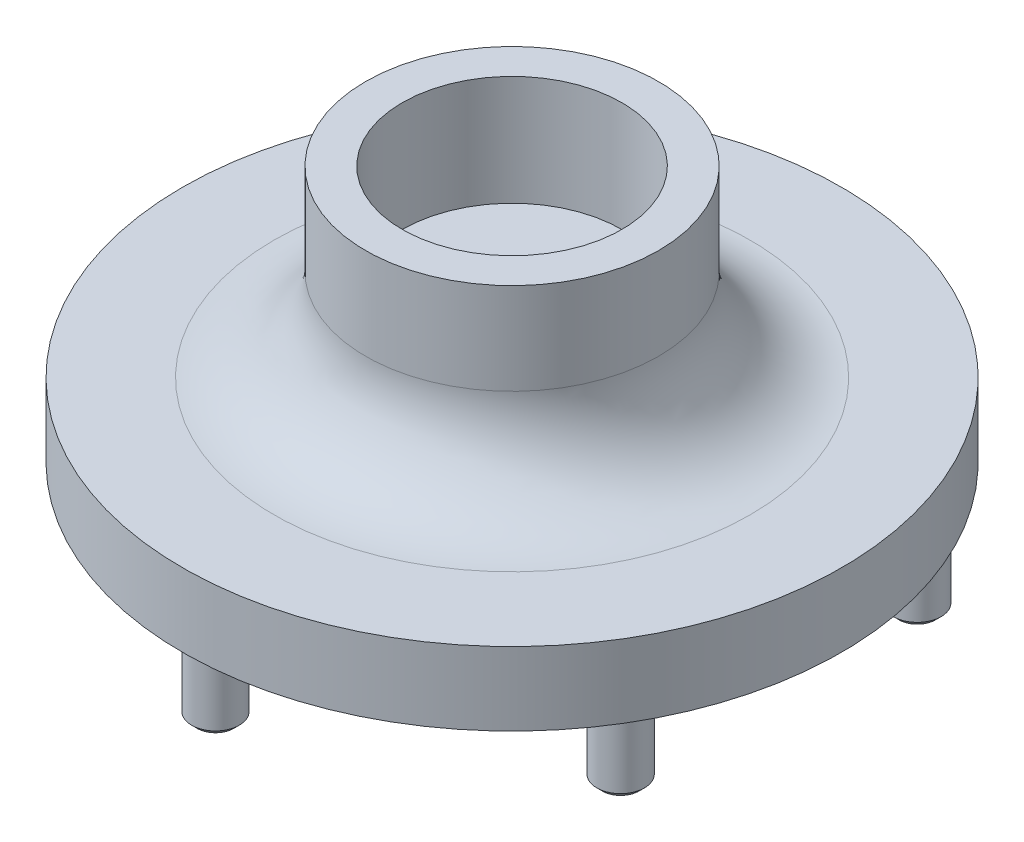
ISO-10303-21;
HEADER;
FILE_DESCRIPTION(('STEP AP214'),'2;1');
FILE_NAME('part.step','',(''),(''),'','','');
FILE_SCHEMA(('AUTOMOTIVE_DESIGN { 1 0 10303 214 1 1 1 1 }'));
ENDSEC;
DATA;
#1=APPLICATION_CONTEXT('core data for automotive mechanical design processes');
#2=APPLICATION_PROTOCOL_DEFINITION('international standard','automotive_design',2000,#1);
#3=PRODUCT_CONTEXT('',#1,'mechanical');
#4=PRODUCT('Part','Part','',(#3));
#5=PRODUCT_RELATED_PRODUCT_CATEGORY('part','',(#4));
#6=PRODUCT_DEFINITION_FORMATION('','',#4);
#7=PRODUCT_DEFINITION_CONTEXT('part definition',#1,'design');
#8=PRODUCT_DEFINITION('design','',#6,#7);
#9=PRODUCT_DEFINITION_SHAPE('','',#8);
#10=(LENGTH_UNIT() NAMED_UNIT(*) SI_UNIT(.MILLI.,.METRE.));
#11=(NAMED_UNIT(*) PLANE_ANGLE_UNIT() SI_UNIT($,.RADIAN.));
#12=(NAMED_UNIT(*) SI_UNIT($,.STERADIAN.) SOLID_ANGLE_UNIT());
#13=UNCERTAINTY_MEASURE_WITH_UNIT(LENGTH_MEASURE(1.E-05),#10,'distance_accuracy_value','');
#14=(GEOMETRIC_REPRESENTATION_CONTEXT(3) GLOBAL_UNCERTAINTY_ASSIGNED_CONTEXT((#13)) GLOBAL_UNIT_ASSIGNED_CONTEXT((#10,
#11,#12)) REPRESENTATION_CONTEXT('',''));
#15=CARTESIAN_POINT('',(0.,0.,0.));
#16=DIRECTION('',(0.,0.,1.));
#17=DIRECTION('',(1.,0.,0.));
#18=AXIS2_PLACEMENT_3D('',#15,#16,#17);
#19=CARTESIAN_POINT('',(0.,0.,0.));
#20=DIRECTION('',(0.,1.,0.));
#21=DIRECTION('',(-1.,0.,0.));
#22=AXIS2_PLACEMENT_3D('',#19,#20,#21);
#23=PLANE('',#22);
#24=CARTESIAN_POINT('',(0.,0.,0.));
#25=DIRECTION('',(0.,1.,0.));
#26=DIRECTION('',(-1.,0.,0.));
#27=AXIS2_PLACEMENT_3D('',#24,#25,#26);
#28=CIRCLE('',#27,16.1432512575363);
#29=CARTESIAN_POINT('',(-16.1432512575363,0.,0.));
#30=VERTEX_POINT('',#29);
#31=EDGE_CURVE('E10',#30,#30,#28,.F.);
#32=ORIENTED_EDGE('',*,*,#31,.T.);
#33=EDGE_LOOP('',(#32));
#34=FACE_BOUND('',#33,.T.);
#35=ADVANCED_FACE('F41',(#34),#23,.F.);
#36=CARTESIAN_POINT('',(0.,75.,0.));
#37=DIRECTION('',(0.,1.,0.));
#38=DIRECTION('',(-1.,0.,0.));
#39=AXIS2_PLACEMENT_3D('',#36,#37,#38);
#40=CYLINDRICAL_SURFACE('',#39,50.);
#41=CARTESIAN_POINT('',(0.,35.,0.));
#42=DIRECTION('',(0.,1.,0.));
#43=DIRECTION('',(-1.,0.,0.));
#44=AXIS2_PLACEMENT_3D('',#41,#42,#43);
#45=CIRCLE('',#44,50.);
#46=CARTESIAN_POINT('',(-50.,35.,0.));
#47=VERTEX_POINT('',#46);
#48=EDGE_CURVE('E112',#47,#47,#45,.T.);
#49=ORIENTED_EDGE('',*,*,#48,.F.);
#50=EDGE_LOOP('',(#49));
#51=FACE_BOUND('',#50,.T.);
#52=CARTESIAN_POINT('',(0.,30.,0.));
#53=DIRECTION('',(0.,1.,0.));
#54=DIRECTION('',(-1.,0.,0.));
#55=AXIS2_PLACEMENT_3D('',#52,#53,#54);
#56=CIRCLE('',#55,50.);
#57=CARTESIAN_POINT('',(-50.,30.,0.));
#58=VERTEX_POINT('',#57);
#59=EDGE_CURVE('E115',#58,#58,#56,.T.);
#60=ORIENTED_EDGE('',*,*,#59,.T.);
#61=EDGE_LOOP('',(#60));
#62=FACE_BOUND('',#61,.T.);
#63=ADVANCED_FACE('F157',(#51,#62),#40,.T.);
#64=CARTESIAN_POINT('',(0.,35.,0.));
#65=DIRECTION('',(0.,1.,0.));
#66=DIRECTION('',(-1.,0.,0.));
#67=AXIS2_PLACEMENT_3D('',#64,#65,#66);
#68=PLANE('',#67);
#69=CARTESIAN_POINT('',(-70.1480577065391,35.,-40.5000000000008));
#70=DIRECTION('',(0.,1.,0.));
#71=DIRECTION('',(-1.,0.,0.));
#72=AXIS2_PLACEMENT_3D('',#69,#70,#71);
#73=CIRCLE('',#72,6.5);
#74=CARTESIAN_POINT('',(-76.6480577065391,35.,-40.5000000000008));
#75=VERTEX_POINT('',#74);
#76=EDGE_CURVE('E133',#75,#75,#73,.T.);
#77=ORIENTED_EDGE('',*,*,#76,.T.);
#78=EDGE_LOOP('',(#77));
#79=FACE_BOUND('',#78,.T.);
#80=CARTESIAN_POINT('',(-70.1480577065399,35.,40.4999999999993));
#81=DIRECTION('',(0.,1.,0.));
#82=DIRECTION('',(-1.,0.,0.));
#83=AXIS2_PLACEMENT_3D('',#80,#81,#82);
#84=CIRCLE('',#83,6.5);
#85=CARTESIAN_POINT('',(-76.6480577065399,35.,40.4999999999993));
#86=VERTEX_POINT('',#85);
#87=EDGE_CURVE('E130',#86,#86,#84,.T.);
#88=ORIENTED_EDGE('',*,*,#87,.T.);
#89=EDGE_LOOP('',(#88));
#90=FACE_BOUND('',#89,.T.);
#91=CARTESIAN_POINT('',(0.,35.,81.));
#92=DIRECTION('',(0.,1.,0.));
#93=DIRECTION('',(-1.,0.,0.));
#94=AXIS2_PLACEMENT_3D('',#91,#92,#93);
#95=CIRCLE('',#94,6.5);
#96=CARTESIAN_POINT('',(-6.5,35.,81.));
#97=VERTEX_POINT('',#96);
#98=EDGE_CURVE('E127',#97,#97,#95,.T.);
#99=ORIENTED_EDGE('',*,*,#98,.T.);
#100=EDGE_LOOP('',(#99));
#101=FACE_BOUND('',#100,.T.);
#102=CARTESIAN_POINT('',(70.1480577065393,35.,40.5000000000003));
#103=DIRECTION('',(0.,1.,0.));
#104=DIRECTION('',(-1.,0.,0.));
#105=AXIS2_PLACEMENT_3D('',#102,#103,#104);
#106=CIRCLE('',#105,6.5);
#107=CARTESIAN_POINT('',(63.6480577065393,35.,40.5000000000003));
#108=VERTEX_POINT('',#107);
#109=EDGE_CURVE('E124',#108,#108,#106,.T.);
#110=ORIENTED_EDGE('',*,*,#109,.T.);
#111=EDGE_LOOP('',(#110));
#112=FACE_BOUND('',#111,.T.);
#113=CARTESIAN_POINT('',(70.1480577065396,35.,-40.4999999999998));
#114=DIRECTION('',(0.,1.,0.));
#115=DIRECTION('',(-1.,0.,0.));
#116=AXIS2_PLACEMENT_3D('',#113,#114,#115);
#117=CIRCLE('',#116,6.5);
#118=CARTESIAN_POINT('',(63.6480577065396,35.,-40.4999999999998));
#119=VERTEX_POINT('',#118);
#120=EDGE_CURVE('E121',#119,#119,#117,.T.);
#121=ORIENTED_EDGE('',*,*,#120,.T.);
#122=EDGE_LOOP('',(#121));
#123=FACE_BOUND('',#122,.T.);
#124=CARTESIAN_POINT('',(0.,35.,-81.));
#125=DIRECTION('',(0.,1.,0.));
#126=DIRECTION('',(-1.,0.,0.));
#127=AXIS2_PLACEMENT_3D('',#124,#125,#126);
#128=CIRCLE('',#127,6.5);
#129=CARTESIAN_POINT('',(-6.5,35.,-81.));
#130=VERTEX_POINT('',#129);
#131=EDGE_CURVE('E118',#130,#130,#128,.T.);
#132=ORIENTED_EDGE('',*,*,#131,.T.);
#133=EDGE_LOOP('',(#132));
#134=FACE_BOUND('',#133,.T.);
#135=CARTESIAN_POINT('',(0.,35.,0.));
#136=DIRECTION('',(0.,1.,0.));
#137=DIRECTION('',(-1.,0.,0.));
#138=AXIS2_PLACEMENT_3D('',#135,#136,#137);
#139=CIRCLE('',#138,90.);
#140=CARTESIAN_POINT('',(-90.,35.,0.));
#141=VERTEX_POINT('',#140);
#142=EDGE_CURVE('E109',#141,#141,#139,.T.);
#143=ORIENTED_EDGE('',*,*,#142,.F.);
#144=EDGE_LOOP('',(#143));
#145=FACE_BOUND('',#144,.T.);
#146=ORIENTED_EDGE('',*,*,#48,.T.);
#147=EDGE_LOOP('',(#146));
#148=FACE_BOUND('',#147,.T.);
#149=ADVANCED_FACE('F137',(#79,#90,#101,#112,#123,#134,#145,#148),#68,.F.);
#150=CARTESIAN_POINT('',(0.,75.,0.));
#151=DIRECTION('',(0.,1.,0.));
#152=DIRECTION('',(-1.,0.,0.));
#153=AXIS2_PLACEMENT_3D('',#150,#151,#152);
#154=CYLINDRICAL_SURFACE('',#153,90.);
#155=CARTESIAN_POINT('',(0.,55.,0.));
#156=DIRECTION('',(0.,1.,0.));
#157=DIRECTION('',(-1.,0.,0.));
#158=AXIS2_PLACEMENT_3D('',#155,#156,#157);
#159=CIRCLE('',#158,90.);
#160=CARTESIAN_POINT('',(-90.,55.,0.));
#161=VERTEX_POINT('',#160);
#162=EDGE_CURVE('E106',#161,#161,#159,.T.);
#163=ORIENTED_EDGE('',*,*,#162,.F.);
#164=EDGE_LOOP('',(#163));
#165=FACE_BOUND('',#164,.T.);
#166=ORIENTED_EDGE('',*,*,#142,.T.);
#167=EDGE_LOOP('',(#166));
#168=FACE_BOUND('',#167,.T.);
#169=ADVANCED_FACE('F170',(#165,#168),#154,.T.);
#170=CARTESIAN_POINT('',(0.,55.,0.));
#171=DIRECTION('',(0.,-1.,0.));
#172=DIRECTION('',(1.,0.,0.));
#173=AXIS2_PLACEMENT_3D('',#170,#171,#172);
#174=PLANE('',#173);
#175=CARTESIAN_POINT('',(0.,55.,0.));
#176=DIRECTION('',(0.,-1.,0.));
#177=DIRECTION('',(1.,0.,0.));
#178=AXIS2_PLACEMENT_3D('',#175,#176,#177);
#179=CIRCLE('',#178,65.);
#180=CARTESIAN_POINT('',(65.,55.,0.));
#181=VERTEX_POINT('',#180);
#182=EDGE_CURVE('E52',#181,#181,#179,.T.);
#183=ORIENTED_EDGE('',*,*,#182,.T.);
#184=EDGE_LOOP('',(#183));
#185=FACE_BOUND('',#184,.T.);
#186=ORIENTED_EDGE('',*,*,#162,.T.);
#187=EDGE_LOOP('',(#186));
#188=FACE_BOUND('',#187,.T.);
#189=ADVANCED_FACE('F173',(#185,#188),#174,.F.);
#190=CARTESIAN_POINT('',(0.,75.,0.));
#191=DIRECTION('',(0.,1.,0.));
#192=DIRECTION('',(-1.,0.,0.));
#193=AXIS2_PLACEMENT_3D('',#190,#191,#192);
#194=CYLINDRICAL_SURFACE('',#193,40.);
#195=CARTESIAN_POINT('',(0.,80.,0.));
#196=DIRECTION('',(0.,-1.,0.));
#197=DIRECTION('',(1.,0.,0.));
#198=AXIS2_PLACEMENT_3D('',#195,#196,#197);
#199=CIRCLE('',#198,40.);
#200=CARTESIAN_POINT('',(40.,80.,0.));
#201=VERTEX_POINT('',#200);
#202=EDGE_CURVE('E56',#201,#201,#199,.F.);
#203=ORIENTED_EDGE('',*,*,#202,.T.);
#204=EDGE_LOOP('',(#203));
#205=FACE_BOUND('',#204,.T.);
#206=CARTESIAN_POINT('',(0.,105.,0.));
#207=DIRECTION('',(0.,1.,0.));
#208=DIRECTION('',(-1.,0.,0.));
#209=AXIS2_PLACEMENT_3D('',#206,#207,#208);
#210=CIRCLE('',#209,40.);
#211=CARTESIAN_POINT('',(-40.,105.,0.));
#212=VERTEX_POINT('',#211);
#213=EDGE_CURVE('E103',#212,#212,#210,.T.);
#214=ORIENTED_EDGE('',*,*,#213,.F.);
#215=EDGE_LOOP('',(#214));
#216=FACE_BOUND('',#215,.T.);
#217=ADVANCED_FACE('F177',(#205,#216),#194,.T.);
#218=CARTESIAN_POINT('',(0.,105.,0.));
#219=DIRECTION('',(0.,-1.,0.));
#220=DIRECTION('',(1.,0.,0.));
#221=AXIS2_PLACEMENT_3D('',#218,#219,#220);
#222=PLANE('',#221);
#223=CARTESIAN_POINT('',(0.,105.,0.));
#224=DIRECTION('',(0.,1.,0.));
#225=DIRECTION('',(-1.,0.,0.));
#226=AXIS2_PLACEMENT_3D('',#223,#224,#225);
#227=CIRCLE('',#226,30.);
#228=CARTESIAN_POINT('',(-30.,105.,0.));
#229=VERTEX_POINT('',#228);
#230=EDGE_CURVE('E100',#229,#229,#227,.T.);
#231=ORIENTED_EDGE('',*,*,#230,.F.);
#232=EDGE_LOOP('',(#231));
#233=FACE_BOUND('',#232,.T.);
#234=ORIENTED_EDGE('',*,*,#213,.T.);
#235=EDGE_LOOP('',(#234));
#236=FACE_BOUND('',#235,.T.);
#237=ADVANCED_FACE('F181',(#233,#236),#222,.F.);
#238=CARTESIAN_POINT('',(0.,75.,0.));
#239=DIRECTION('',(0.,1.,0.));
#240=DIRECTION('',(-1.,0.,0.));
#241=AXIS2_PLACEMENT_3D('',#238,#239,#240);
#242=CYLINDRICAL_SURFACE('',#241,30.);
#243=CARTESIAN_POINT('',(0.,75.,0.));
#244=DIRECTION('',(0.,1.,0.));
#245=DIRECTION('',(-1.,0.,0.));
#246=AXIS2_PLACEMENT_3D('',#243,#244,#245);
#247=CIRCLE('',#246,30.);
#248=CARTESIAN_POINT('',(-30.,75.,0.));
#249=VERTEX_POINT('',#248);
#250=EDGE_CURVE('E97',#249,#249,#247,.T.);
#251=ORIENTED_EDGE('',*,*,#250,.F.);
#252=EDGE_LOOP('',(#251));
#253=FACE_BOUND('',#252,.T.);
#254=ORIENTED_EDGE('',*,*,#230,.T.);
#255=EDGE_LOOP('',(#254));
#256=FACE_BOUND('',#255,.T.);
#257=ADVANCED_FACE('F185',(#253,#256),#242,.F.);
#258=CARTESIAN_POINT('',(0.,75.,0.));
#259=DIRECTION('',(0.,-1.,0.));
#260=DIRECTION('',(1.,0.,0.));
#261=AXIS2_PLACEMENT_3D('',#258,#259,#260);
#262=PLANE('',#261);
#263=ORIENTED_EDGE('',*,*,#250,.T.);
#264=EDGE_LOOP('',(#263));
#265=FACE_BOUND('',#264,.T.);
#266=ADVANCED_FACE('F189',(#265),#262,.F.);
#267=CARTESIAN_POINT('',(0.,15.,-81.));
#268=DIRECTION('',(0.,1.,0.));
#269=DIRECTION('',(-1.,0.,0.));
#270=AXIS2_PLACEMENT_3D('',#267,#268,#269);
#271=CYLINDRICAL_SURFACE('',#270,6.5);
#272=CARTESIAN_POINT('',(0.,16.5,-81.));
#273=DIRECTION('',(0.,1.,0.));
#274=DIRECTION('',(-1.,0.,0.));
#275=AXIS2_PLACEMENT_3D('',#272,#273,#274);
#276=CIRCLE('',#275,6.5);
#277=CARTESIAN_POINT('',(-6.5,16.5,-81.));
#278=VERTEX_POINT('',#277);
#279=EDGE_CURVE('E70',#278,#278,#276,.T.);
#280=ORIENTED_EDGE('',*,*,#279,.T.);
#281=EDGE_LOOP('',(#280));
#282=FACE_BOUND('',#281,.T.);
#283=ORIENTED_EDGE('',*,*,#131,.F.);
#284=EDGE_LOOP('',(#283));
#285=FACE_BOUND('',#284,.T.);
#286=ADVANCED_FACE('F165',(#282,#285),#271,.T.);
#287=CARTESIAN_POINT('',(0.,15.,-81.));
#288=DIRECTION('',(0.,1.,0.));
#289=DIRECTION('',(-1.,0.,0.));
#290=AXIS2_PLACEMENT_3D('',#287,#288,#289);
#291=PLANE('',#290);
#292=CARTESIAN_POINT('',(0.,15.,-81.));
#293=DIRECTION('',(0.,1.,0.));
#294=DIRECTION('',(-1.,0.,0.));
#295=AXIS2_PLACEMENT_3D('',#292,#293,#294);
#296=CIRCLE('',#295,5.);
#297=CARTESIAN_POINT('',(-5.,15.,-81.));
#298=VERTEX_POINT('',#297);
#299=EDGE_CURVE('E67',#298,#298,#296,.F.);
#300=ORIENTED_EDGE('',*,*,#299,.T.);
#301=EDGE_LOOP('',(#300));
#302=FACE_BOUND('',#301,.T.);
#303=ADVANCED_FACE('F444',(#302),#291,.F.);
#304=CARTESIAN_POINT('',(70.1480577065396,15.,-40.4999999999998));
#305=DIRECTION('',(0.,1.,0.));
#306=DIRECTION('',(-1.,0.,0.));
#307=AXIS2_PLACEMENT_3D('',#304,#305,#306);
#308=CYLINDRICAL_SURFACE('',#307,6.5);
#309=CARTESIAN_POINT('',(70.1480577065396,16.5,-40.4999999999998));
#310=DIRECTION('',(0.,1.,0.));
#311=DIRECTION('',(0.,0.,1.));
#312=AXIS2_PLACEMENT_3D('',#309,#310,#311);
#313=CIRCLE('',#312,6.5);
#314=CARTESIAN_POINT('',(70.1480577065396,16.5,-33.9999999999998));
#315=VERTEX_POINT('',#314);
#316=EDGE_CURVE('E76',#315,#315,#313,.T.);
#317=ORIENTED_EDGE('',*,*,#316,.T.);
#318=EDGE_LOOP('',(#317));
#319=FACE_BOUND('',#318,.T.);
#320=ORIENTED_EDGE('',*,*,#120,.F.);
#321=EDGE_LOOP('',(#320));
#322=FACE_BOUND('',#321,.T.);
#323=ADVANCED_FACE('F433',(#319,#322),#308,.T.);
#324=CARTESIAN_POINT('',(70.1480577065396,15.,-40.4999999999998));
#325=DIRECTION('',(0.,1.,0.));
#326=DIRECTION('',(-0.499999999999998,0.,-0.86602540378444));
#327=AXIS2_PLACEMENT_3D('',#324,#325,#326);
#328=PLANE('',#327);
#329=CARTESIAN_POINT('',(70.1480577065396,15.,-40.4999999999998));
#330=DIRECTION('',(0.,1.,0.));
#331=DIRECTION('',(-1.,0.,0.));
#332=AXIS2_PLACEMENT_3D('',#329,#330,#331);
#333=CIRCLE('',#332,4.99999999999999);
#334=CARTESIAN_POINT('',(65.1480577065396,15.,-40.4999999999998));
#335=VERTEX_POINT('',#334);
#336=EDGE_CURVE('E73',#335,#335,#333,.F.);
#337=ORIENTED_EDGE('',*,*,#336,.T.);
#338=EDGE_LOOP('',(#337));
#339=FACE_BOUND('',#338,.T.);
#340=ADVANCED_FACE('F422',(#339),#328,.F.);
#341=CARTESIAN_POINT('',(70.1480577065393,15.,40.5000000000003));
#342=DIRECTION('',(0.,1.,0.));
#343=DIRECTION('',(-1.,0.,0.));
#344=AXIS2_PLACEMENT_3D('',#341,#342,#343);
#345=CYLINDRICAL_SURFACE('',#344,6.5);
#346=CARTESIAN_POINT('',(70.1480577065393,16.5,40.5000000000003));
#347=DIRECTION('',(0.,1.,0.));
#348=DIRECTION('',(0.,0.,1.));
#349=AXIS2_PLACEMENT_3D('',#346,#347,#348);
#350=CIRCLE('',#349,6.5);
#351=CARTESIAN_POINT('',(70.1480577065393,16.5,47.0000000000003));
#352=VERTEX_POINT('',#351);
#353=EDGE_CURVE('E82',#352,#352,#350,.T.);
#354=ORIENTED_EDGE('',*,*,#353,.T.);
#355=EDGE_LOOP('',(#354));
#356=FACE_BOUND('',#355,.T.);
#357=ORIENTED_EDGE('',*,*,#109,.F.);
#358=EDGE_LOOP('',(#357));
#359=FACE_BOUND('',#358,.T.);
#360=ADVANCED_FACE('F410',(#356,#359),#345,.T.);
#361=CARTESIAN_POINT('',(70.1480577065393,15.,40.5000000000003));
#362=DIRECTION('',(0.,1.,0.));
#363=DIRECTION('',(0.500000000000004,0.,-0.866025403784436));
#364=AXIS2_PLACEMENT_3D('',#361,#362,#363);
#365=PLANE('',#364);
#366=CARTESIAN_POINT('',(70.1480577065393,15.,40.5000000000003));
#367=DIRECTION('',(0.,1.,0.));
#368=DIRECTION('',(-1.,0.,0.));
#369=AXIS2_PLACEMENT_3D('',#366,#367,#368);
#370=CIRCLE('',#369,4.99999999999998);
#371=CARTESIAN_POINT('',(65.1480577065394,15.,40.5000000000003));
#372=VERTEX_POINT('',#371);
#373=EDGE_CURVE('E79',#372,#372,#370,.F.);
#374=ORIENTED_EDGE('',*,*,#373,.T.);
#375=EDGE_LOOP('',(#374));
#376=FACE_BOUND('',#375,.T.);
#377=ADVANCED_FACE('F398',(#376),#365,.F.);
#378=CARTESIAN_POINT('',(0.,15.,81.));
#379=DIRECTION('',(0.,1.,0.));
#380=DIRECTION('',(-1.,0.,0.));
#381=AXIS2_PLACEMENT_3D('',#378,#379,#380);
#382=CYLINDRICAL_SURFACE('',#381,6.5);
#383=CARTESIAN_POINT('',(0.,16.5,81.));
#384=DIRECTION('',(0.,1.,0.));
#385=DIRECTION('',(-1.,0.,0.));
#386=AXIS2_PLACEMENT_3D('',#383,#384,#385);
#387=CIRCLE('',#386,6.5);
#388=CARTESIAN_POINT('',(-6.5,16.5,81.));
#389=VERTEX_POINT('',#388);
#390=EDGE_CURVE('E88',#389,#389,#387,.T.);
#391=ORIENTED_EDGE('',*,*,#390,.T.);
#392=EDGE_LOOP('',(#391));
#393=FACE_BOUND('',#392,.T.);
#394=ORIENTED_EDGE('',*,*,#98,.F.);
#395=EDGE_LOOP('',(#394));
#396=FACE_BOUND('',#395,.T.);
#397=ADVANCED_FACE('F386',(#393,#396),#382,.T.);
#398=CARTESIAN_POINT('',(0.,15.,81.));
#399=DIRECTION('',(0.,1.,0.));
#400=DIRECTION('',(1.,0.,0.));
#401=AXIS2_PLACEMENT_3D('',#398,#399,#400);
#402=PLANE('',#401);
#403=CARTESIAN_POINT('',(0.,15.,81.));
#404=DIRECTION('',(0.,1.,0.));
#405=DIRECTION('',(-1.,0.,0.));
#406=AXIS2_PLACEMENT_3D('',#403,#404,#405);
#407=CIRCLE('',#406,5.);
#408=CARTESIAN_POINT('',(-5.,15.,81.));
#409=VERTEX_POINT('',#408);
#410=EDGE_CURVE('E85',#409,#409,#407,.F.);
#411=ORIENTED_EDGE('',*,*,#410,.T.);
#412=EDGE_LOOP('',(#411));
#413=FACE_BOUND('',#412,.T.);
#414=ADVANCED_FACE('F374',(#413),#402,.F.);
#415=CARTESIAN_POINT('',(-70.1480577065399,15.,40.4999999999993));
#416=DIRECTION('',(0.,1.,0.));
#417=DIRECTION('',(-1.,0.,0.));
#418=AXIS2_PLACEMENT_3D('',#415,#416,#417);
#419=CYLINDRICAL_SURFACE('',#418,6.5);
#420=CARTESIAN_POINT('',(-70.1480577065399,16.4999999999999,40.4999999999993));
#421=DIRECTION('',(0.,1.,0.));
#422=DIRECTION('',(0.,0.,1.));
#423=AXIS2_PLACEMENT_3D('',#420,#421,#422);
#424=CIRCLE('',#423,6.5);
#425=CARTESIAN_POINT('',(-70.1480577065399,16.4999999999999,46.9999999999994));
#426=VERTEX_POINT('',#425);
#427=EDGE_CURVE('E94',#426,#426,#424,.T.);
#428=ORIENTED_EDGE('',*,*,#427,.T.);
#429=EDGE_LOOP('',(#428));
#430=FACE_BOUND('',#429,.T.);
#431=ORIENTED_EDGE('',*,*,#87,.F.);
#432=EDGE_LOOP('',(#431));
#433=FACE_BOUND('',#432,.T.);
#434=ADVANCED_FACE('F153',(#430,#433),#419,.T.);
#435=CARTESIAN_POINT('',(-70.1480577065399,15.,40.4999999999993));
#436=DIRECTION('',(0.,1.,0.));
#437=DIRECTION('',(0.499999999999992,0.,0.866025403784443));
#438=AXIS2_PLACEMENT_3D('',#435,#436,#437);
#439=PLANE('',#438);
#440=CARTESIAN_POINT('',(-70.1480577065399,15.,40.4999999999993));
#441=DIRECTION('',(0.,1.,0.));
#442=DIRECTION('',(-1.,0.,0.));
#443=AXIS2_PLACEMENT_3D('',#440,#441,#442);
#444=CIRCLE('',#443,5.00000000000003);
#445=CARTESIAN_POINT('',(-75.1480577065399,15.,40.4999999999993));
#446=VERTEX_POINT('',#445);
#447=EDGE_CURVE('E91',#446,#446,#444,.F.);
#448=ORIENTED_EDGE('',*,*,#447,.T.);
#449=EDGE_LOOP('',(#448));
#450=FACE_BOUND('',#449,.T.);
#451=ADVANCED_FACE('F143',(#450),#439,.F.);
#452=CARTESIAN_POINT('',(-70.1480577065391,15.,-40.5000000000008));
#453=DIRECTION('',(0.,1.,0.));
#454=DIRECTION('',(-1.,0.,0.));
#455=AXIS2_PLACEMENT_3D('',#452,#453,#454);
#456=CYLINDRICAL_SURFACE('',#455,6.5);
#457=CARTESIAN_POINT('',(-70.1480577065391,16.5,-40.5000000000008));
#458=DIRECTION('',(0.,1.,0.));
#459=DIRECTION('',(0.,0.,1.));
#460=AXIS2_PLACEMENT_3D('',#457,#458,#459);
#461=CIRCLE('',#460,6.5);
#462=CARTESIAN_POINT('',(-70.1480577065391,16.5,-34.0000000000008));
#463=VERTEX_POINT('',#462);
#464=EDGE_CURVE('E64',#463,#463,#461,.T.);
#465=ORIENTED_EDGE('',*,*,#464,.T.);
#466=EDGE_LOOP('',(#465));
#467=FACE_BOUND('',#466,.T.);
#468=ORIENTED_EDGE('',*,*,#76,.F.);
#469=EDGE_LOOP('',(#468));
#470=FACE_BOUND('',#469,.T.);
#471=ADVANCED_FACE('F140',(#467,#470),#456,.T.);
#472=CARTESIAN_POINT('',(-70.1480577065391,15.,-40.5000000000008));
#473=DIRECTION('',(0.,1.,0.));
#474=DIRECTION('',(-0.50000000000001,0.,0.866025403784433));
#475=AXIS2_PLACEMENT_3D('',#472,#473,#474);
#476=PLANE('',#475);
#477=CARTESIAN_POINT('',(-70.1480577065391,15.,-40.5000000000008));
#478=DIRECTION('',(0.,1.,0.));
#479=DIRECTION('',(-1.,0.,0.));
#480=AXIS2_PLACEMENT_3D('',#477,#478,#479);
#481=CIRCLE('',#480,4.99999999999999);
#482=CARTESIAN_POINT('',(-75.148057706539,15.,-40.5000000000008));
#483=VERTEX_POINT('',#482);
#484=EDGE_CURVE('E61',#483,#483,#481,.F.);
#485=ORIENTED_EDGE('',*,*,#484,.T.);
#486=EDGE_LOOP('',(#485));
#487=FACE_BOUND('',#486,.T.);
#488=ADVANCED_FACE('F142',(#487),#476,.F.);
#489=CARTESIAN_POINT('',(-70.1480577065399,16.4999999999999,40.4999999999993));
#490=DIRECTION('',(0.,1.,0.));
#491=DIRECTION('',(0.,0.,1.));
#492=AXIS2_PLACEMENT_3D('',#489,#490,#491);
#493=CONICAL_SURFACE('',#492,6.5,0.785398163397457);
#494=ORIENTED_EDGE('',*,*,#447,.F.);
#495=EDGE_LOOP('',(#494));
#496=FACE_BOUND('',#495,.T.);
#497=ORIENTED_EDGE('',*,*,#427,.F.);
#498=EDGE_LOOP('',(#497));
#499=FACE_BOUND('',#498,.T.);
#500=ADVANCED_FACE('F150',(#496,#499),#493,.T.);
#501=CARTESIAN_POINT('',(0.,16.5,81.));
#502=DIRECTION('',(0.,1.,0.));
#503=DIRECTION('',(-1.,0.,0.));
#504=AXIS2_PLACEMENT_3D('',#501,#502,#503);
#505=CONICAL_SURFACE('',#504,6.5,0.785398163397446);
#506=ORIENTED_EDGE('',*,*,#410,.F.);
#507=EDGE_LOOP('',(#506));
#508=FACE_BOUND('',#507,.T.);
#509=ORIENTED_EDGE('',*,*,#390,.F.);
#510=EDGE_LOOP('',(#509));
#511=FACE_BOUND('',#510,.T.);
#512=ADVANCED_FACE('F200',(#508,#511),#505,.T.);
#513=CARTESIAN_POINT('',(70.1480577065393,16.5,40.5000000000003));
#514=DIRECTION('',(0.,1.,0.));
#515=DIRECTION('',(0.,0.,1.));
#516=AXIS2_PLACEMENT_3D('',#513,#514,#515);
#517=CONICAL_SURFACE('',#516,6.5,0.785398163397453);
#518=ORIENTED_EDGE('',*,*,#373,.F.);
#519=EDGE_LOOP('',(#518));
#520=FACE_BOUND('',#519,.T.);
#521=ORIENTED_EDGE('',*,*,#353,.F.);
#522=EDGE_LOOP('',(#521));
#523=FACE_BOUND('',#522,.T.);
#524=ADVANCED_FACE('F207',(#520,#523),#517,.T.);
#525=CARTESIAN_POINT('',(70.1480577065396,16.5,-40.4999999999998));
#526=DIRECTION('',(0.,1.,0.));
#527=DIRECTION('',(0.,0.,1.));
#528=AXIS2_PLACEMENT_3D('',#525,#526,#527);
#529=CONICAL_SURFACE('',#528,6.5,0.785398163397452);
#530=ORIENTED_EDGE('',*,*,#336,.F.);
#531=EDGE_LOOP('',(#530));
#532=FACE_BOUND('',#531,.T.);
#533=ORIENTED_EDGE('',*,*,#316,.F.);
#534=EDGE_LOOP('',(#533));
#535=FACE_BOUND('',#534,.T.);
#536=ADVANCED_FACE('F214',(#532,#535),#529,.T.);
#537=CARTESIAN_POINT('',(0.,16.5,-81.));
#538=DIRECTION('',(0.,1.,0.));
#539=DIRECTION('',(-1.,0.,0.));
#540=AXIS2_PLACEMENT_3D('',#537,#538,#539);
#541=CONICAL_SURFACE('',#540,6.5,0.785398163397446);
#542=ORIENTED_EDGE('',*,*,#299,.F.);
#543=EDGE_LOOP('',(#542));
#544=FACE_BOUND('',#543,.T.);
#545=ORIENTED_EDGE('',*,*,#279,.F.);
#546=EDGE_LOOP('',(#545));
#547=FACE_BOUND('',#546,.T.);
#548=ADVANCED_FACE('F221',(#544,#547),#541,.T.);
#549=CARTESIAN_POINT('',(-70.1480577065391,16.5,-40.5000000000008));
#550=DIRECTION('',(0.,1.,0.));
#551=DIRECTION('',(0.,0.,1.));
#552=AXIS2_PLACEMENT_3D('',#549,#550,#551);
#553=CONICAL_SURFACE('',#552,6.5,0.785398163397452);
#554=ORIENTED_EDGE('',*,*,#484,.F.);
#555=EDGE_LOOP('',(#554));
#556=FACE_BOUND('',#555,.T.);
#557=ORIENTED_EDGE('',*,*,#464,.F.);
#558=EDGE_LOOP('',(#557));
#559=FACE_BOUND('',#558,.T.);
#560=ADVANCED_FACE('F228',(#556,#559),#553,.T.);
#561=CARTESIAN_POINT('',(0.,5.5051025721682,0.));
#562=DIRECTION('',(0.,1.,0.));
#563=DIRECTION('',(-1.,0.,0.));
#564=AXIS2_PLACEMENT_3D('',#561,#562,#563);
#565=TOROIDAL_SURFACE('',#564,55.,25.);
#566=CARTESIAN_POINT('',(0.,11.4394134645631,0.));
#567=DIRECTION('',(0.,-1.,0.));
#568=DIRECTION('',(1.,0.,0.));
#569=AXIS2_PLACEMENT_3D('',#566,#567,#568);
#570=CIRCLE('',#569,30.7145320359602);
#571=CARTESIAN_POINT('',(30.7145320359602,11.4394134645631,0.));
#572=VERTEX_POINT('',#571);
#573=EDGE_CURVE('E48',#572,#572,#570,.F.);
#574=ORIENTED_EDGE('',*,*,#573,.T.);
#575=EDGE_LOOP('',(#574));
#576=FACE_BOUND('',#575,.T.);
#577=ORIENTED_EDGE('',*,*,#59,.F.);
#578=EDGE_LOOP('',(#577));
#579=FACE_BOUND('',#578,.T.);
#580=ADVANCED_FACE('F234',(#576,#579),#565,.F.);
#581=CARTESIAN_POINT('',(0.,80.,0.));
#582=DIRECTION('',(0.,-1.,0.));
#583=DIRECTION('',(1.,0.,0.));
#584=AXIS2_PLACEMENT_3D('',#581,#582,#583);
#585=TOROIDAL_SURFACE('',#584,65.,25.);
#586=ORIENTED_EDGE('',*,*,#182,.F.);
#587=EDGE_LOOP('',(#586));
#588=FACE_BOUND('',#587,.T.);
#589=ORIENTED_EDGE('',*,*,#202,.F.);
#590=EDGE_LOOP('',(#589));
#591=FACE_BOUND('',#590,.T.);
#592=ADVANCED_FACE('F237',(#588,#591),#585,.F.);
#593=CARTESIAN_POINT('',(0.,15.,0.));
#594=DIRECTION('',(0.,-1.,0.));
#595=DIRECTION('',(1.,0.,0.));
#596=AXIS2_PLACEMENT_3D('',#593,#594,#595);
#597=TOROIDAL_SURFACE('',#596,16.1432512575363,15.);
#598=ORIENTED_EDGE('',*,*,#31,.F.);
#599=EDGE_LOOP('',(#598));
#600=FACE_BOUND('',#599,.T.);
#601=ORIENTED_EDGE('',*,*,#573,.F.);
#602=EDGE_LOOP('',(#601));
#603=FACE_BOUND('',#602,.T.);
#604=ADVANCED_FACE('F43',(#600,#603),#597,.T.);
#605=CLOSED_SHELL('',(#35,#63,#149,#169,#189,#217,#237,#257,#266,#286,#303,#323,#340,#360,#377,
#397,#414,#434,#451,#471,#488,#500,#512,#524,#536,#548,#560,#580,#592,#604));
#606=MANIFOLD_SOLID_BREP('B2',#605);
#607=ADVANCED_BREP_SHAPE_REPRESENTATION('',(#18,#606),#14);
#608=SHAPE_DEFINITION_REPRESENTATION(#9,#607);
ENDSEC;
END-ISO-10303-21;
